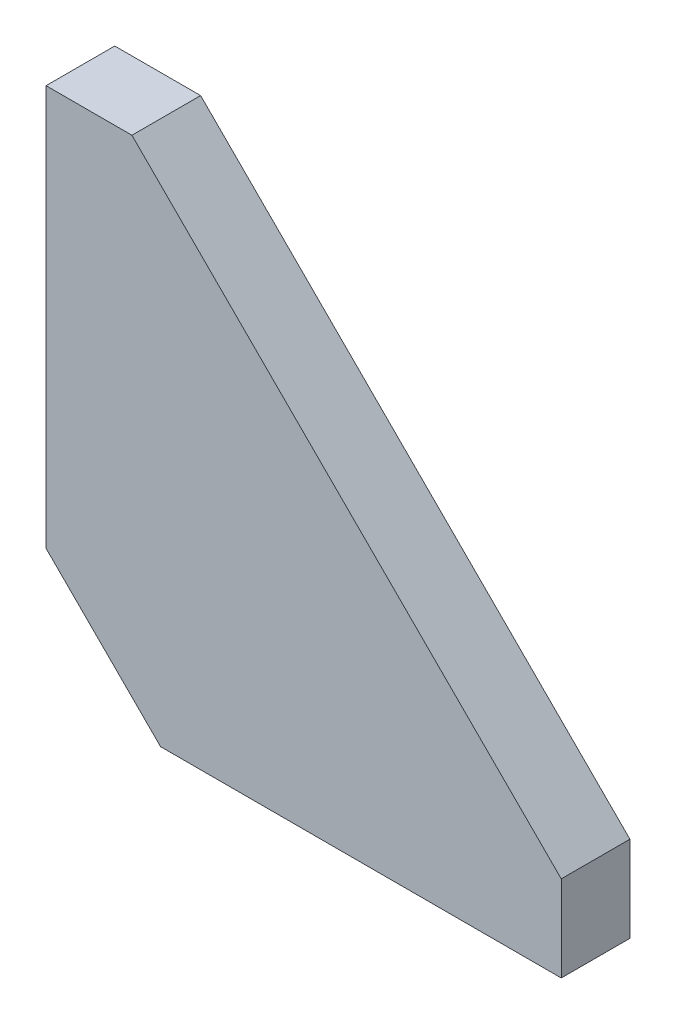
ISO-10303-21;
HEADER;
FILE_DESCRIPTION(('STEP AP214'),'2;1');
FILE_NAME('part.step','',(''),(''),'','','');
FILE_SCHEMA(('AUTOMOTIVE_DESIGN { 1 0 10303 214 1 1 1 1 }'));
ENDSEC;
DATA;
#1=APPLICATION_CONTEXT('core data for automotive mechanical design processes');
#2=APPLICATION_PROTOCOL_DEFINITION('international standard','automotive_design',2000,#1);
#3=PRODUCT_CONTEXT('',#1,'mechanical');
#4=PRODUCT('Part','Part','',(#3));
#5=PRODUCT_RELATED_PRODUCT_CATEGORY('part','',(#4));
#6=PRODUCT_DEFINITION_FORMATION('','',#4);
#7=PRODUCT_DEFINITION_CONTEXT('part definition',#1,'design');
#8=PRODUCT_DEFINITION('design','',#6,#7);
#9=PRODUCT_DEFINITION_SHAPE('','',#8);
#10=(LENGTH_UNIT() NAMED_UNIT(*) SI_UNIT(.MILLI.,.METRE.));
#11=(NAMED_UNIT(*) PLANE_ANGLE_UNIT() SI_UNIT($,.RADIAN.));
#12=(NAMED_UNIT(*) SI_UNIT($,.STERADIAN.) SOLID_ANGLE_UNIT());
#13=UNCERTAINTY_MEASURE_WITH_UNIT(LENGTH_MEASURE(1.E-05),#10,'distance_accuracy_value','');
#14=(GEOMETRIC_REPRESENTATION_CONTEXT(3) GLOBAL_UNCERTAINTY_ASSIGNED_CONTEXT((#13)) GLOBAL_UNIT_ASSIGNED_CONTEXT((#10,
#11,#12)) REPRESENTATION_CONTEXT('',''));
#15=CARTESIAN_POINT('',(0.,0.,0.));
#16=DIRECTION('',(0.,0.,1.));
#17=DIRECTION('',(1.,0.,0.));
#18=AXIS2_PLACEMENT_3D('',#15,#16,#17);
#19=CARTESIAN_POINT('',(-20.0000000000002,90.,12.));
#20=DIRECTION('',(0.,-1.,0.));
#21=DIRECTION('',(0.,0.,-1.));
#22=AXIS2_PLACEMENT_3D('',#19,#20,#21);
#23=PLANE('',#22);
#24=DIRECTION('',(-1.,0.,0.));
#25=VECTOR('',#24,1.);
#26=CARTESIAN_POINT('',(-20.0000000000002,90.,0.));
#27=LINE('',#26,#25);
#28=CARTESIAN_POINT('',(-5.00000000000023,90.,0.));
#29=VERTEX_POINT('',#28);
#30=CARTESIAN_POINT('',(-20.0000000000002,90.,0.));
#31=VERTEX_POINT('',#30);
#32=EDGE_CURVE('E117',#29,#31,#27,.T.);
#33=ORIENTED_EDGE('',*,*,#32,.T.);
#34=DIRECTION('',(0.,0.,-1.));
#35=VECTOR('',#34,1.);
#36=CARTESIAN_POINT('',(-20.0000000000002,90.,12.));
#37=LINE('',#36,#35);
#38=CARTESIAN_POINT('',(-20.0000000000002,90.,12.));
#39=VERTEX_POINT('',#38);
#40=EDGE_CURVE('E11',#39,#31,#37,.T.);
#41=ORIENTED_EDGE('',*,*,#40,.F.);
#42=DIRECTION('',(-1.,0.,0.));
#43=VECTOR('',#42,1.);
#44=CARTESIAN_POINT('',(-20.0000000000002,90.,12.));
#45=LINE('',#44,#43);
#46=CARTESIAN_POINT('',(-5.00000000000023,90.,12.));
#47=VERTEX_POINT('',#46);
#48=EDGE_CURVE('E127',#47,#39,#45,.T.);
#49=ORIENTED_EDGE('',*,*,#48,.F.);
#50=DIRECTION('',(0.,0.,-1.));
#51=VECTOR('',#50,1.);
#52=CARTESIAN_POINT('',(-5.00000000000023,90.,12.));
#53=LINE('',#52,#51);
#54=EDGE_CURVE('E113',#47,#29,#53,.T.);
#55=ORIENTED_EDGE('',*,*,#54,.T.);
#56=EDGE_LOOP('',(#33,#41,#49,#55));
#57=FACE_BOUND('',#56,.T.);
#58=ADVANCED_FACE('F33',(#57),#23,.F.);
#59=CARTESIAN_POINT('',(-20.0000000000002,20.,12.));
#60=DIRECTION('',(1.,0.,0.));
#61=DIRECTION('',(0.,1.,0.));
#62=AXIS2_PLACEMENT_3D('',#59,#60,#61);
#63=PLANE('',#62);
#64=DIRECTION('',(0.,-1.,0.));
#65=VECTOR('',#64,1.);
#66=CARTESIAN_POINT('',(-20.0000000000002,20.,0.));
#67=LINE('',#66,#65);
#68=CARTESIAN_POINT('',(-20.0000000000002,20.,0.));
#69=VERTEX_POINT('',#68);
#70=EDGE_CURVE('E120',#31,#69,#67,.T.);
#71=ORIENTED_EDGE('',*,*,#70,.T.);
#72=DIRECTION('',(0.,0.,-1.));
#73=VECTOR('',#72,1.);
#74=CARTESIAN_POINT('',(-20.0000000000002,20.,12.));
#75=LINE('',#74,#73);
#76=CARTESIAN_POINT('',(-20.0000000000002,20.,12.));
#77=VERTEX_POINT('',#76);
#78=EDGE_CURVE('E41',#77,#69,#75,.T.);
#79=ORIENTED_EDGE('',*,*,#78,.F.);
#80=DIRECTION('',(0.,-1.,0.));
#81=VECTOR('',#80,1.);
#82=CARTESIAN_POINT('',(-20.0000000000002,20.,12.));
#83=LINE('',#82,#81);
#84=EDGE_CURVE('E86',#39,#77,#83,.T.);
#85=ORIENTED_EDGE('',*,*,#84,.F.);
#86=ORIENTED_EDGE('',*,*,#40,.T.);
#87=EDGE_LOOP('',(#71,#79,#85,#86));
#88=FACE_BOUND('',#87,.T.);
#89=ADVANCED_FACE('F151',(#88),#63,.F.);
#90=CARTESIAN_POINT('',(-20.0000000000002,20.,12.));
#91=DIRECTION('',(0.707106781186544,0.707106781186551,0.));
#92=DIRECTION('',(-0.707106781186551,0.707106781186544,0.));
#93=AXIS2_PLACEMENT_3D('',#90,#91,#92);
#94=PLANE('',#93);
#95=DIRECTION('',(0.707106781186551,-0.707106781186544,0.));
#96=VECTOR('',#95,1.);
#97=CARTESIAN_POINT('',(-20.0000000000002,20.,0.));
#98=LINE('',#97,#96);
#99=CARTESIAN_POINT('',(0.,0.,0.));
#100=VERTEX_POINT('',#99);
#101=EDGE_CURVE('E122',#69,#100,#98,.T.);
#102=ORIENTED_EDGE('',*,*,#101,.T.);
#103=DIRECTION('',(0.,0.,-1.));
#104=VECTOR('',#103,1.);
#105=CARTESIAN_POINT('',(0.,0.,12.));
#106=LINE('',#105,#104);
#107=CARTESIAN_POINT('',(0.,0.,12.));
#108=VERTEX_POINT('',#107);
#109=EDGE_CURVE('E108',#108,#100,#106,.T.);
#110=ORIENTED_EDGE('',*,*,#109,.F.);
#111=DIRECTION('',(0.707106781186551,-0.707106781186544,0.));
#112=VECTOR('',#111,1.);
#113=CARTESIAN_POINT('',(-20.0000000000002,20.,12.));
#114=LINE('',#113,#112);
#115=EDGE_CURVE('E99',#77,#108,#114,.T.);
#116=ORIENTED_EDGE('',*,*,#115,.F.);
#117=ORIENTED_EDGE('',*,*,#78,.T.);
#118=EDGE_LOOP('',(#102,#110,#116,#117));
#119=FACE_BOUND('',#118,.T.);
#120=ADVANCED_FACE('F133',(#119),#94,.F.);
#121=CARTESIAN_POINT('',(69.9999999999998,0.,12.));
#122=DIRECTION('',(0.,1.,0.));
#123=DIRECTION('',(-1.,0.,0.));
#124=AXIS2_PLACEMENT_3D('',#121,#122,#123);
#125=PLANE('',#124);
#126=DIRECTION('',(1.,0.,0.));
#127=VECTOR('',#126,1.);
#128=CARTESIAN_POINT('',(69.9999999999998,0.,0.));
#129=LINE('',#128,#127);
#130=CARTESIAN_POINT('',(69.9999999999998,0.,0.));
#131=VERTEX_POINT('',#130);
#132=EDGE_CURVE('E107',#100,#131,#129,.T.);
#133=ORIENTED_EDGE('',*,*,#132,.T.);
#134=DIRECTION('',(0.,0.,-1.));
#135=VECTOR('',#134,1.);
#136=CARTESIAN_POINT('',(69.9999999999998,0.,12.));
#137=LINE('',#136,#135);
#138=CARTESIAN_POINT('',(69.9999999999998,0.,12.));
#139=VERTEX_POINT('',#138);
#140=EDGE_CURVE('E104',#139,#131,#137,.T.);
#141=ORIENTED_EDGE('',*,*,#140,.F.);
#142=DIRECTION('',(1.,0.,0.));
#143=VECTOR('',#142,1.);
#144=CARTESIAN_POINT('',(69.9999999999998,0.,12.));
#145=LINE('',#144,#143);
#146=EDGE_CURVE('E93',#108,#139,#145,.T.);
#147=ORIENTED_EDGE('',*,*,#146,.F.);
#148=ORIENTED_EDGE('',*,*,#109,.T.);
#149=EDGE_LOOP('',(#133,#141,#147,#148));
#150=FACE_BOUND('',#149,.T.);
#151=ADVANCED_FACE('F105',(#150),#125,.F.);
#152=CARTESIAN_POINT('',(69.9999999999998,15.,12.));
#153=DIRECTION('',(-1.,0.,0.));
#154=DIRECTION('',(0.,0.,1.));
#155=AXIS2_PLACEMENT_3D('',#152,#153,#154);
#156=PLANE('',#155);
#157=DIRECTION('',(0.,1.,0.));
#158=VECTOR('',#157,1.);
#159=CARTESIAN_POINT('',(69.9999999999998,15.,0.));
#160=LINE('',#159,#158);
#161=CARTESIAN_POINT('',(69.9999999999998,15.,0.));
#162=VERTEX_POINT('',#161);
#163=EDGE_CURVE('E72',#131,#162,#160,.T.);
#164=ORIENTED_EDGE('',*,*,#163,.T.);
#165=DIRECTION('',(0.,0.,-1.));
#166=VECTOR('',#165,1.);
#167=CARTESIAN_POINT('',(69.9999999999998,15.,12.));
#168=LINE('',#167,#166);
#169=CARTESIAN_POINT('',(69.9999999999998,15.,12.));
#170=VERTEX_POINT('',#169);
#171=EDGE_CURVE('E109',#170,#162,#168,.T.);
#172=ORIENTED_EDGE('',*,*,#171,.F.);
#173=DIRECTION('',(0.,1.,0.));
#174=VECTOR('',#173,1.);
#175=CARTESIAN_POINT('',(69.9999999999998,15.,12.));
#176=LINE('',#175,#174);
#177=EDGE_CURVE('E97',#139,#170,#176,.T.);
#178=ORIENTED_EDGE('',*,*,#177,.F.);
#179=ORIENTED_EDGE('',*,*,#140,.T.);
#180=EDGE_LOOP('',(#164,#172,#178,#179));
#181=FACE_BOUND('',#180,.T.);
#182=ADVANCED_FACE('F111',(#181),#156,.F.);
#183=CARTESIAN_POINT('',(-5.00000000000023,90.,12.));
#184=DIRECTION('',(-0.707106781186547,-0.707106781186548,0.));
#185=DIRECTION('',(0.707106781186548,-0.707106781186547,0.));
#186=AXIS2_PLACEMENT_3D('',#183,#184,#185);
#187=PLANE('',#186);
#188=DIRECTION('',(-0.707106781186548,0.707106781186548,0.));
#189=VECTOR('',#188,1.);
#190=CARTESIAN_POINT('',(-5.00000000000023,90.,0.));
#191=LINE('',#190,#189);
#192=EDGE_CURVE('E78',#162,#29,#191,.T.);
#193=ORIENTED_EDGE('',*,*,#192,.T.);
#194=ORIENTED_EDGE('',*,*,#54,.F.);
#195=DIRECTION('',(-0.707106781186548,0.707106781186548,0.));
#196=VECTOR('',#195,1.);
#197=CARTESIAN_POINT('',(-5.00000000000023,90.,12.));
#198=LINE('',#197,#196);
#199=EDGE_CURVE('E49',#170,#47,#198,.T.);
#200=ORIENTED_EDGE('',*,*,#199,.F.);
#201=ORIENTED_EDGE('',*,*,#171,.T.);
#202=EDGE_LOOP('',(#193,#194,#200,#201));
#203=FACE_BOUND('',#202,.T.);
#204=ADVANCED_FACE('F140',(#203),#187,.F.);
#205=CARTESIAN_POINT('',(0.,0.,12.));
#206=DIRECTION('',(0.,0.,-1.));
#207=DIRECTION('',(-1.,0.,0.));
#208=AXIS2_PLACEMENT_3D('',#205,#206,#207);
#209=PLANE('',#208);
#210=ORIENTED_EDGE('',*,*,#48,.T.);
#211=ORIENTED_EDGE('',*,*,#84,.T.);
#212=ORIENTED_EDGE('',*,*,#115,.T.);
#213=ORIENTED_EDGE('',*,*,#146,.T.);
#214=ORIENTED_EDGE('',*,*,#177,.T.);
#215=ORIENTED_EDGE('',*,*,#199,.T.);
#216=EDGE_LOOP('',(#210,#211,#212,#213,#214,#215));
#217=FACE_BOUND('',#216,.T.);
#218=ADVANCED_FACE('F95',(#217),#209,.F.);
#219=CARTESIAN_POINT('',(0.,0.,0.));
#220=DIRECTION('',(0.,0.,-1.));
#221=DIRECTION('',(-1.,0.,0.));
#222=AXIS2_PLACEMENT_3D('',#219,#220,#221);
#223=PLANE('',#222);
#224=ORIENTED_EDGE('',*,*,#32,.F.);
#225=ORIENTED_EDGE('',*,*,#192,.F.);
#226=ORIENTED_EDGE('',*,*,#163,.F.);
#227=ORIENTED_EDGE('',*,*,#132,.F.);
#228=ORIENTED_EDGE('',*,*,#101,.F.);
#229=ORIENTED_EDGE('',*,*,#70,.F.);
#230=EDGE_LOOP('',(#224,#225,#226,#227,#228,#229));
#231=FACE_BOUND('',#230,.T.);
#232=ADVANCED_FACE('F136',(#231),#223,.T.);
#233=CLOSED_SHELL('',(#58,#89,#120,#151,#182,#204,#218,#232));
#234=MANIFOLD_SOLID_BREP('B2',#233);
#235=ADVANCED_BREP_SHAPE_REPRESENTATION('',(#18,#234),#14);
#236=SHAPE_DEFINITION_REPRESENTATION(#9,#235);
ENDSEC;
END-ISO-10303-21;
